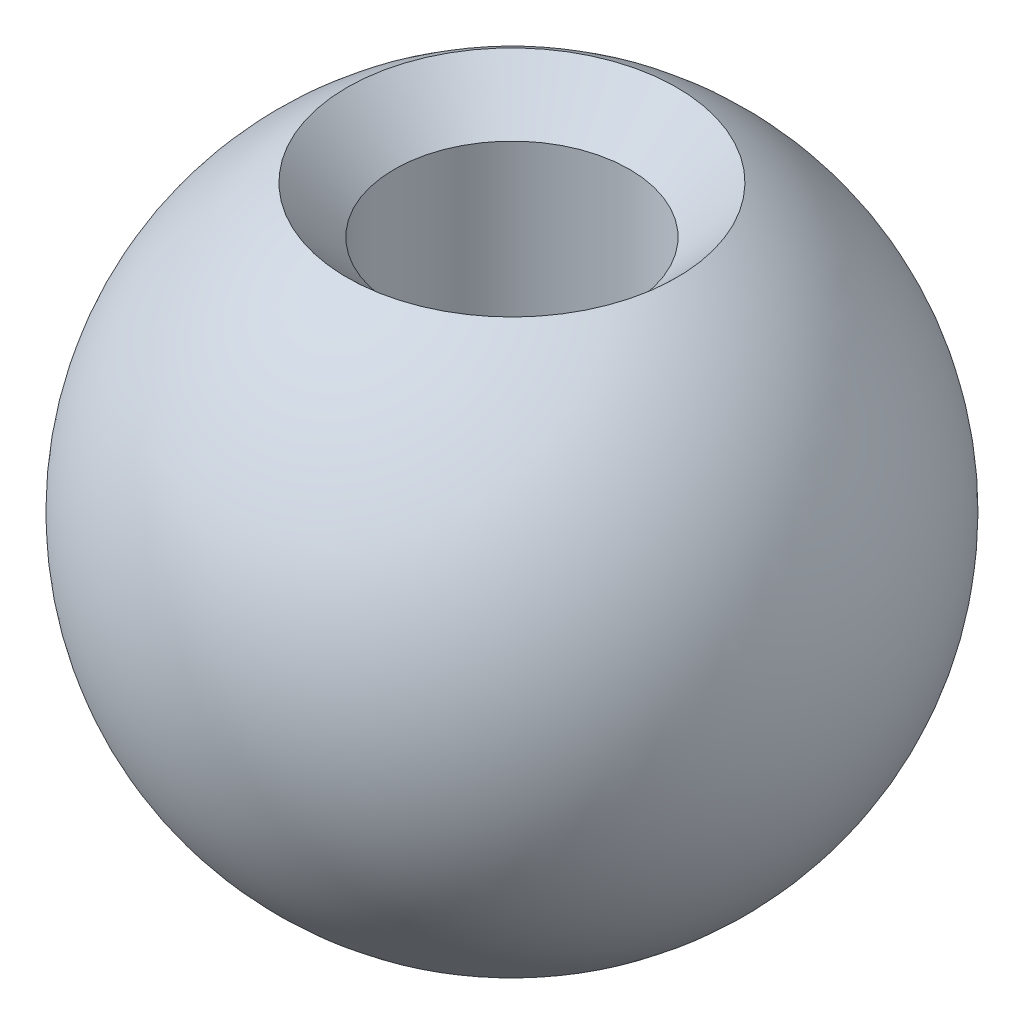
ISO-10303-21;
HEADER;
FILE_DESCRIPTION(('STEP AP214'),'2;1');
FILE_NAME('part.step','',(''),(''),'','','');
FILE_SCHEMA(('AUTOMOTIVE_DESIGN { 1 0 10303 214 1 1 1 1 }'));
ENDSEC;
DATA;
#1=APPLICATION_CONTEXT('core data for automotive mechanical design processes');
#2=APPLICATION_PROTOCOL_DEFINITION('international standard','automotive_design',2000,#1);
#3=PRODUCT_CONTEXT('',#1,'mechanical');
#4=PRODUCT('Part','Part','',(#3));
#5=PRODUCT_RELATED_PRODUCT_CATEGORY('part','',(#4));
#6=PRODUCT_DEFINITION_FORMATION('','',#4);
#7=PRODUCT_DEFINITION_CONTEXT('part definition',#1,'design');
#8=PRODUCT_DEFINITION('design','',#6,#7);
#9=PRODUCT_DEFINITION_SHAPE('','',#8);
#10=(LENGTH_UNIT() NAMED_UNIT(*) SI_UNIT(.MILLI.,.METRE.));
#11=(NAMED_UNIT(*) PLANE_ANGLE_UNIT() SI_UNIT($,.RADIAN.));
#12=(NAMED_UNIT(*) SI_UNIT($,.STERADIAN.) SOLID_ANGLE_UNIT());
#13=UNCERTAINTY_MEASURE_WITH_UNIT(LENGTH_MEASURE(1.E-05),#10,'distance_accuracy_value','');
#14=(GEOMETRIC_REPRESENTATION_CONTEXT(3) GLOBAL_UNCERTAINTY_ASSIGNED_CONTEXT((#13)) GLOBAL_UNIT_ASSIGNED_CONTEXT((#10,
#11,#12)) REPRESENTATION_CONTEXT('',''));
#15=CARTESIAN_POINT('',(0.,0.,0.));
#16=DIRECTION('',(0.,0.,1.));
#17=DIRECTION('',(1.,0.,0.));
#18=AXIS2_PLACEMENT_3D('',#15,#16,#17);
#19=CARTESIAN_POINT('',(0.,0.,0.));
#20=DIRECTION('',(0.,1.,0.));
#21=DIRECTION('',(1.,0.,0.));
#22=AXIS2_PLACEMENT_3D('',#19,#20,#21);
#23=SPHERICAL_SURFACE('',#22,5.55625);
#24=CARTESIAN_POINT('',(0.,4.81185364977729,0.));
#25=DIRECTION('',(0.,1.,0.));
#26=DIRECTION('',(-1.,0.,0.));
#27=AXIS2_PLACEMENT_3D('',#24,#25,#26);
#28=CIRCLE('',#27,2.778125);
#29=CARTESIAN_POINT('',(-2.778125,4.81185364977728,0.));
#30=VERTEX_POINT('',#29);
#31=EDGE_CURVE('E43',#30,#30,#28,.T.);
#32=ORIENTED_EDGE('',*,*,#31,.F.);
#33=EDGE_LOOP('',(#32));
#34=FACE_BOUND('',#33,.T.);
#35=CARTESIAN_POINT('',(0.,-5.19102693332446,0.));
#36=DIRECTION('',(0.,1.,0.));
#37=DIRECTION('',(-1.,0.,0.));
#38=AXIS2_PLACEMENT_3D('',#35,#36,#37);
#39=CIRCLE('',#38,1.9812);
#40=CARTESIAN_POINT('',(-1.9812,-5.19102693332446,0.));
#41=VERTEX_POINT('',#40);
#42=EDGE_CURVE('E10',#41,#41,#39,.T.);
#43=ORIENTED_EDGE('',*,*,#42,.T.);
#44=EDGE_LOOP('',(#43));
#45=FACE_BOUND('',#44,.T.);
#46=ADVANCED_FACE('F33',(#34,#45),#23,.T.);
#47=CARTESIAN_POINT('',(0.,9.6174040578996,0.));
#48=DIRECTION('',(0.,1.,0.));
#49=DIRECTION('',(-1.,0.,0.));
#50=AXIS2_PLACEMENT_3D('',#47,#48,#49);
#51=CYLINDRICAL_SURFACE('',#50,1.9812);
#52=ORIENTED_EDGE('',*,*,#42,.F.);
#53=EDGE_LOOP('',(#52));
#54=FACE_BOUND('',#53,.T.);
#55=CARTESIAN_POINT('',(0.,4.01492864977728,0.));
#56=DIRECTION('',(0.,1.,0.));
#57=DIRECTION('',(-1.,0.,0.));
#58=AXIS2_PLACEMENT_3D('',#55,#56,#57);
#59=CIRCLE('',#58,1.9812);
#60=CARTESIAN_POINT('',(-1.9812,4.01492864977728,0.));
#61=VERTEX_POINT('',#60);
#62=EDGE_CURVE('E39',#61,#61,#59,.T.);
#63=ORIENTED_EDGE('',*,*,#62,.T.);
#64=EDGE_LOOP('',(#63));
#65=FACE_BOUND('',#64,.T.);
#66=ADVANCED_FACE('F53',(#54,#65),#51,.F.);
#67=CARTESIAN_POINT('',(0.,4.81185364977729,0.));
#68=DIRECTION('',(0.,1.,0.));
#69=DIRECTION('',(-1.,0.,0.));
#70=AXIS2_PLACEMENT_3D('',#67,#68,#69);
#71=CONICAL_SURFACE('',#70,2.778125,0.785398163397446);
#72=ORIENTED_EDGE('',*,*,#62,.F.);
#73=EDGE_LOOP('',(#72));
#74=FACE_BOUND('',#73,.T.);
#75=ORIENTED_EDGE('',*,*,#31,.T.);
#76=EDGE_LOOP('',(#75));
#77=FACE_BOUND('',#76,.T.);
#78=ADVANCED_FACE('F50',(#74,#77),#71,.F.);
#79=CLOSED_SHELL('',(#46,#66,#78));
#80=MANIFOLD_SOLID_BREP('B2',#79);
#81=ADVANCED_BREP_SHAPE_REPRESENTATION('',(#18,#80),#14);
#82=SHAPE_DEFINITION_REPRESENTATION(#9,#81);
ENDSEC;
END-ISO-10303-21;
